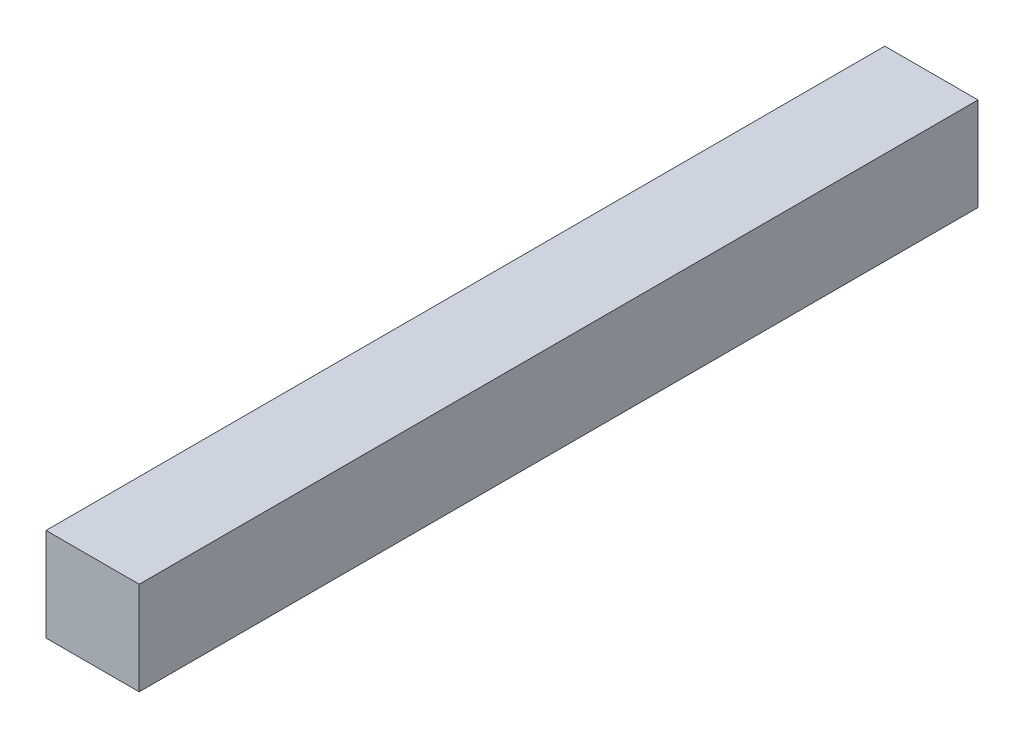
ISO-10303-21;
HEADER;
FILE_DESCRIPTION(('STEP AP214'),'2;1');
FILE_NAME('part.step','',(''),(''),'','','');
FILE_SCHEMA(('AUTOMOTIVE_DESIGN { 1 0 10303 214 1 1 1 1 }'));
ENDSEC;
DATA;
#1=APPLICATION_CONTEXT('core data for automotive mechanical design processes');
#2=APPLICATION_PROTOCOL_DEFINITION('international standard','automotive_design',2000,#1);
#3=PRODUCT_CONTEXT('',#1,'mechanical');
#4=PRODUCT('Part','Part','',(#3));
#5=PRODUCT_RELATED_PRODUCT_CATEGORY('part','',(#4));
#6=PRODUCT_DEFINITION_FORMATION('','',#4);
#7=PRODUCT_DEFINITION_CONTEXT('part definition',#1,'design');
#8=PRODUCT_DEFINITION('design','',#6,#7);
#9=PRODUCT_DEFINITION_SHAPE('','',#8);
#10=(LENGTH_UNIT() NAMED_UNIT(*) SI_UNIT(.MILLI.,.METRE.));
#11=(NAMED_UNIT(*) PLANE_ANGLE_UNIT() SI_UNIT($,.RADIAN.));
#12=(NAMED_UNIT(*) SI_UNIT($,.STERADIAN.) SOLID_ANGLE_UNIT());
#13=UNCERTAINTY_MEASURE_WITH_UNIT(LENGTH_MEASURE(1.E-05),#10,'distance_accuracy_value','');
#14=(GEOMETRIC_REPRESENTATION_CONTEXT(3) GLOBAL_UNCERTAINTY_ASSIGNED_CONTEXT((#13)) GLOBAL_UNIT_ASSIGNED_CONTEXT((#10,
#11,#12)) REPRESENTATION_CONTEXT('',''));
#15=CARTESIAN_POINT('',(0.,0.,0.));
#16=DIRECTION('',(0.,0.,1.));
#17=DIRECTION('',(1.,0.,0.));
#18=AXIS2_PLACEMENT_3D('',#15,#16,#17);
#19=CARTESIAN_POINT('',(-0.2499995,0.2499995,0.));
#20=DIRECTION('',(0.,1.,0.));
#21=DIRECTION('',(0.,0.,1.));
#22=AXIS2_PLACEMENT_3D('',#19,#20,#21);
#23=PLANE('',#22);
#24=DIRECTION('',(0.,0.,-1.));
#25=VECTOR('',#24,1.);
#26=CARTESIAN_POINT('',(0.2499995,0.2499995,0.));
#27=LINE('',#26,#25);
#28=CARTESIAN_POINT('',(0.2499995,0.2499995,0.));
#29=VERTEX_POINT('',#28);
#30=CARTESIAN_POINT('',(0.2499995,0.2499995,4.50000116));
#31=VERTEX_POINT('',#30);
#32=EDGE_CURVE('E62',#29,#31,#27,.F.);
#33=ORIENTED_EDGE('',*,*,#32,.F.);
#34=DIRECTION('',(1.,0.,0.));
#35=VECTOR('',#34,1.);
#36=CARTESIAN_POINT('',(-0.2499995,0.2499995,0.));
#37=LINE('',#36,#35);
#38=CARTESIAN_POINT('',(-0.2499995,0.2499995,0.));
#39=VERTEX_POINT('',#38);
#40=EDGE_CURVE('E20',#29,#39,#37,.F.);
#41=ORIENTED_EDGE('',*,*,#40,.T.);
#42=DIRECTION('',(0.,0.,1.));
#43=VECTOR('',#42,1.);
#44=CARTESIAN_POINT('',(-0.2499995,0.2499995,0.));
#45=LINE('',#44,#43);
#46=CARTESIAN_POINT('',(-0.2499995,0.2499995,4.50000116));
#47=VERTEX_POINT('',#46);
#48=EDGE_CURVE('E69',#47,#39,#45,.F.);
#49=ORIENTED_EDGE('',*,*,#48,.F.);
#50=DIRECTION('',(1.,0.,0.));
#51=VECTOR('',#50,1.);
#52=CARTESIAN_POINT('',(0.2499995,0.2499995,4.50000116));
#53=LINE('',#52,#51);
#54=EDGE_CURVE('E56',#31,#47,#53,.F.);
#55=ORIENTED_EDGE('',*,*,#54,.F.);
#56=EDGE_LOOP('',(#33,#41,#49,#55));
#57=FACE_BOUND('',#56,.T.);
#58=ADVANCED_FACE('F17',(#57),#23,.T.);
#59=CARTESIAN_POINT('',(0.2499995,0.2499995,0.));
#60=DIRECTION('',(1.,0.,0.));
#61=DIRECTION('',(0.,0.,-1.));
#62=AXIS2_PLACEMENT_3D('',#59,#60,#61);
#63=PLANE('',#62);
#64=DIRECTION('',(0.,0.,-1.));
#65=VECTOR('',#64,1.);
#66=CARTESIAN_POINT('',(0.2499995,-0.2499995,0.));
#67=LINE('',#66,#65);
#68=CARTESIAN_POINT('',(0.2499995,-0.2499995,0.));
#69=VERTEX_POINT('',#68);
#70=CARTESIAN_POINT('',(0.2499995,-0.2499995,4.50000116));
#71=VERTEX_POINT('',#70);
#72=EDGE_CURVE('E83',#69,#71,#67,.F.);
#73=ORIENTED_EDGE('',*,*,#72,.F.);
#74=DIRECTION('',(0.,1.,0.));
#75=VECTOR('',#74,1.);
#76=CARTESIAN_POINT('',(0.2499995,-0.2499995,0.));
#77=LINE('',#76,#75);
#78=EDGE_CURVE('E67',#69,#29,#77,.T.);
#79=ORIENTED_EDGE('',*,*,#78,.T.);
#80=ORIENTED_EDGE('',*,*,#32,.T.);
#81=DIRECTION('',(0.,1.,0.));
#82=VECTOR('',#81,1.);
#83=CARTESIAN_POINT('',(0.2499995,-0.2499995,4.50000116));
#84=LINE('',#83,#82);
#85=EDGE_CURVE('E64',#71,#31,#84,.T.);
#86=ORIENTED_EDGE('',*,*,#85,.F.);
#87=EDGE_LOOP('',(#73,#79,#80,#86));
#88=FACE_BOUND('',#87,.T.);
#89=ADVANCED_FACE('F63',(#88),#63,.T.);
#90=CARTESIAN_POINT('',(0.2499995,-0.2499995,4.50000116));
#91=DIRECTION('',(0.,0.,1.));
#92=DIRECTION('',(1.,0.,0.));
#93=AXIS2_PLACEMENT_3D('',#90,#91,#92);
#94=PLANE('',#93);
#95=DIRECTION('',(0.,1.,0.));
#96=VECTOR('',#95,1.);
#97=CARTESIAN_POINT('',(-0.2499995,-0.2499995,4.50000116));
#98=LINE('',#97,#96);
#99=CARTESIAN_POINT('',(-0.2499995,-0.2499995,4.50000116));
#100=VERTEX_POINT('',#99);
#101=EDGE_CURVE('E71',#100,#47,#98,.T.);
#102=ORIENTED_EDGE('',*,*,#101,.F.);
#103=DIRECTION('',(1.,0.,0.));
#104=VECTOR('',#103,1.);
#105=CARTESIAN_POINT('',(0.2499995,-0.2499995,4.50000116));
#106=LINE('',#105,#104);
#107=EDGE_CURVE('E75',#71,#100,#106,.F.);
#108=ORIENTED_EDGE('',*,*,#107,.F.);
#109=ORIENTED_EDGE('',*,*,#85,.T.);
#110=ORIENTED_EDGE('',*,*,#54,.T.);
#111=EDGE_LOOP('',(#102,#108,#109,#110));
#112=FACE_BOUND('',#111,.T.);
#113=ADVANCED_FACE('F73',(#112),#94,.T.);
#114=CARTESIAN_POINT('',(-0.2499995,-0.2499995,0.));
#115=DIRECTION('',(-1.,0.,0.));
#116=DIRECTION('',(0.,0.,1.));
#117=AXIS2_PLACEMENT_3D('',#114,#115,#116);
#118=PLANE('',#117);
#119=ORIENTED_EDGE('',*,*,#48,.T.);
#120=DIRECTION('',(0.,1.,0.));
#121=VECTOR('',#120,1.);
#122=CARTESIAN_POINT('',(-0.2499995,-0.2499995,0.));
#123=LINE('',#122,#121);
#124=CARTESIAN_POINT('',(-0.2499995,-0.2499995,0.));
#125=VERTEX_POINT('',#124);
#126=EDGE_CURVE('E35',#39,#125,#123,.F.);
#127=ORIENTED_EDGE('',*,*,#126,.T.);
#128=DIRECTION('',(0.,0.,-1.));
#129=VECTOR('',#128,1.);
#130=CARTESIAN_POINT('',(-0.2499995,-0.2499995,0.));
#131=LINE('',#130,#129);
#132=EDGE_CURVE('E26',#100,#125,#131,.T.);
#133=ORIENTED_EDGE('',*,*,#132,.F.);
#134=ORIENTED_EDGE('',*,*,#101,.T.);
#135=EDGE_LOOP('',(#119,#127,#133,#134));
#136=FACE_BOUND('',#135,.T.);
#137=ADVANCED_FACE('F89',(#136),#118,.T.);
#138=CARTESIAN_POINT('',(0.2499995,-0.2499995,0.));
#139=DIRECTION('',(0.,0.,1.));
#140=DIRECTION('',(1.,0.,0.));
#141=AXIS2_PLACEMENT_3D('',#138,#139,#140);
#142=PLANE('',#141);
#143=ORIENTED_EDGE('',*,*,#126,.F.);
#144=ORIENTED_EDGE('',*,*,#40,.F.);
#145=ORIENTED_EDGE('',*,*,#78,.F.);
#146=DIRECTION('',(1.,0.,0.));
#147=VECTOR('',#146,1.);
#148=CARTESIAN_POINT('',(0.2499995,-0.2499995,0.));
#149=LINE('',#148,#147);
#150=EDGE_CURVE('E11',#125,#69,#149,.T.);
#151=ORIENTED_EDGE('',*,*,#150,.F.);
#152=EDGE_LOOP('',(#143,#144,#145,#151));
#153=FACE_BOUND('',#152,.T.);
#154=ADVANCED_FACE('F91',(#153),#142,.F.);
#155=CARTESIAN_POINT('',(0.2499995,-0.2499995,0.));
#156=DIRECTION('',(0.,-1.,0.));
#157=DIRECTION('',(0.,0.,-1.));
#158=AXIS2_PLACEMENT_3D('',#155,#156,#157);
#159=PLANE('',#158);
#160=ORIENTED_EDGE('',*,*,#132,.T.);
#161=ORIENTED_EDGE('',*,*,#150,.T.);
#162=ORIENTED_EDGE('',*,*,#72,.T.);
#163=ORIENTED_EDGE('',*,*,#107,.T.);
#164=EDGE_LOOP('',(#160,#161,#162,#163));
#165=FACE_BOUND('',#164,.T.);
#166=ADVANCED_FACE('F88',(#165),#159,.T.);
#167=CLOSED_SHELL('',(#58,#89,#113,#137,#154,#166));
#168=MANIFOLD_SOLID_BREP('B1',#167);
#169=ADVANCED_BREP_SHAPE_REPRESENTATION('',(#18,#168),#14);
#170=SHAPE_DEFINITION_REPRESENTATION(#9,#169);
ENDSEC;
END-ISO-10303-21;
